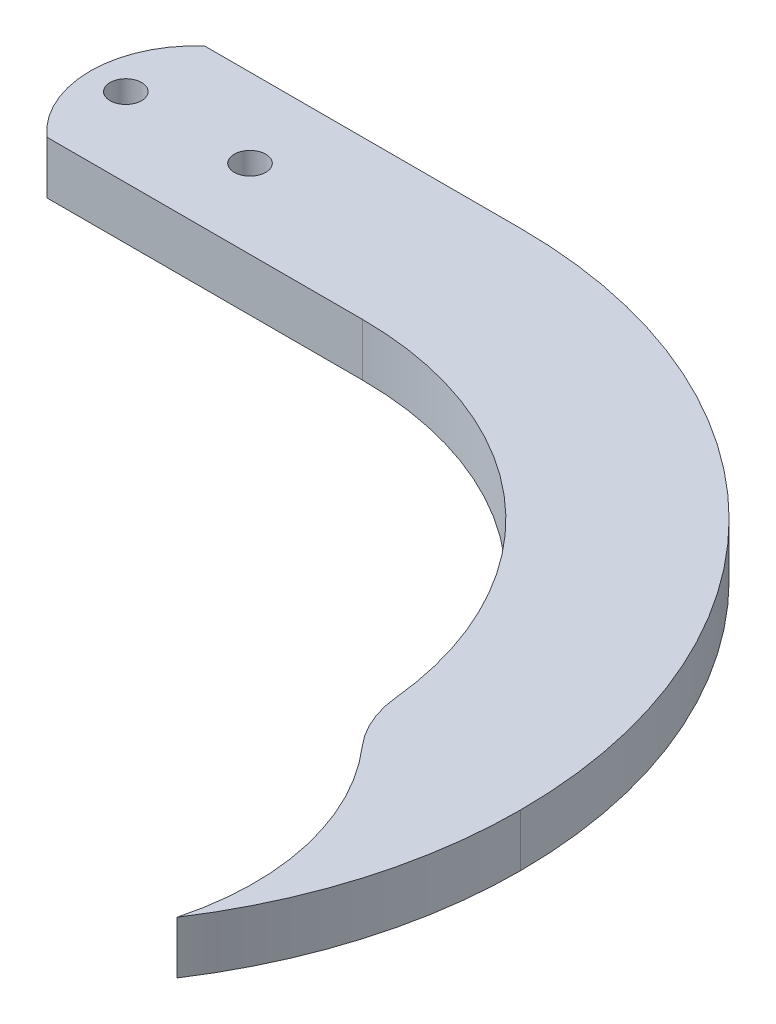
ISO-10303-21;
HEADER;
FILE_DESCRIPTION(('STEP AP214'),'2;1');
FILE_NAME('part.step','',(''),(''),'','','');
FILE_SCHEMA(('AUTOMOTIVE_DESIGN { 1 0 10303 214 1 1 1 1 }'));
ENDSEC;
DATA;
#1=APPLICATION_CONTEXT('core data for automotive mechanical design processes');
#2=APPLICATION_PROTOCOL_DEFINITION('international standard','automotive_design',2000,#1);
#3=PRODUCT_CONTEXT('',#1,'mechanical');
#4=PRODUCT('Part','Part','',(#3));
#5=PRODUCT_RELATED_PRODUCT_CATEGORY('part','',(#4));
#6=PRODUCT_DEFINITION_FORMATION('','',#4);
#7=PRODUCT_DEFINITION_CONTEXT('part definition',#1,'design');
#8=PRODUCT_DEFINITION('design','',#6,#7);
#9=PRODUCT_DEFINITION_SHAPE('','',#8);
#10=(LENGTH_UNIT() NAMED_UNIT(*) SI_UNIT(.MILLI.,.METRE.));
#11=(NAMED_UNIT(*) PLANE_ANGLE_UNIT() SI_UNIT($,.RADIAN.));
#12=(NAMED_UNIT(*) SI_UNIT($,.STERADIAN.) SOLID_ANGLE_UNIT());
#13=UNCERTAINTY_MEASURE_WITH_UNIT(LENGTH_MEASURE(1.E-05),#10,'distance_accuracy_value','');
#14=(GEOMETRIC_REPRESENTATION_CONTEXT(3) GLOBAL_UNCERTAINTY_ASSIGNED_CONTEXT((#13)) GLOBAL_UNIT_ASSIGNED_CONTEXT((#10,
#11,#12)) REPRESENTATION_CONTEXT('',''));
#15=CARTESIAN_POINT('',(0.,0.,0.));
#16=DIRECTION('',(0.,0.,1.));
#17=DIRECTION('',(1.,0.,0.));
#18=AXIS2_PLACEMENT_3D('',#15,#16,#17);
#19=CARTESIAN_POINT('',(0.,5.,0.));
#20=DIRECTION('',(0.,1.,0.));
#21=DIRECTION('',(0.,0.,1.));
#22=AXIS2_PLACEMENT_3D('',#19,#20,#21);
#23=PLANE('',#22);
#24=CARTESIAN_POINT('',(30.,5.,40.375));
#25=DIRECTION('',(0.,1.,0.));
#26=DIRECTION('',(0.,0.,1.));
#27=AXIS2_PLACEMENT_3D('',#24,#25,#26);
#28=CIRCLE('',#27,32.875);
#29=CARTESIAN_POINT('',(62.7098407903248,5.,37.0838086546663));
#30=VERTEX_POINT('',#29);
#31=CARTESIAN_POINT('',(30.,5.,7.5));
#32=VERTEX_POINT('',#31);
#33=EDGE_CURVE('E155',#30,#32,#28,.T.);
#34=ORIENTED_EDGE('',*,*,#33,.F.);
#35=CARTESIAN_POINT('',(72.6596022474579,5.,36.0826858119792));
#36=DIRECTION('',(0.,1.,0.));
#37=DIRECTION('',(0.,0.,1.));
#38=AXIS2_PLACEMENT_3D('',#35,#36,#37);
#39=CIRCLE('',#38,10.);
#40=CARTESIAN_POINT('',(65.1088411432145,5.,42.6390572738966));
#41=VERTEX_POINT('',#40);
#42=EDGE_CURVE('E14',#30,#41,#39,.T.);
#43=ORIENTED_EDGE('',*,*,#42,.T.);
#44=CARTESIAN_POINT('',(46.231938382606,5.,59.0299859286902));
#45=DIRECTION('',(0.,1.,0.));
#46=DIRECTION('',(0.,0.,1.));
#47=AXIS2_PLACEMENT_3D('',#44,#45,#46);
#48=CIRCLE('',#47,25.);
#49=CARTESIAN_POINT('',(70.375,5.,65.5194062216531));
#50=VERTEX_POINT('',#49);
#51=EDGE_CURVE('E115',#41,#50,#48,.F.);
#52=ORIENTED_EDGE('',*,*,#51,.T.);
#53=CARTESIAN_POINT('',(31.975589050699,5.,40.375));
#54=DIRECTION('',(0.,1.,0.));
#55=DIRECTION('',(0.,0.,1.));
#56=AXIS2_PLACEMENT_3D('',#53,#54,#55);
#57=CIRCLE('',#56,45.8994109493009);
#58=CARTESIAN_POINT('',(77.875,5.,40.375));
#59=VERTEX_POINT('',#58);
#60=EDGE_CURVE('E119',#59,#50,#57,.F.);
#61=ORIENTED_EDGE('',*,*,#60,.F.);
#62=CARTESIAN_POINT('',(30.,5.,40.375));
#63=DIRECTION('',(0.,1.,0.));
#64=DIRECTION('',(0.,0.,1.));
#65=AXIS2_PLACEMENT_3D('',#62,#63,#64);
#66=CIRCLE('',#65,47.875);
#67=CARTESIAN_POINT('',(30.,5.,-7.5));
#68=VERTEX_POINT('',#67);
#69=EDGE_CURVE('E157',#59,#68,#66,.T.);
#70=ORIENTED_EDGE('',*,*,#69,.T.);
#71=DIRECTION('',(1.,0.,0.));
#72=VECTOR('',#71,1.);
#73=CARTESIAN_POINT('',(0.,5.,-7.5));
#74=LINE('',#73,#72);
#75=CARTESIAN_POINT('',(0.,5.,-7.5));
#76=VERTEX_POINT('',#75);
#77=EDGE_CURVE('E159',#76,#68,#74,.T.);
#78=ORIENTED_EDGE('',*,*,#77,.F.);
#79=CARTESIAN_POINT('',(6.61437827766148,5.,0.));
#80=DIRECTION('',(0.,1.,0.));
#81=DIRECTION('',(0.,0.,1.));
#82=AXIS2_PLACEMENT_3D('',#79,#80,#81);
#83=CIRCLE('',#82,10.);
#84=CARTESIAN_POINT('',(0.,5.,7.5));
#85=VERTEX_POINT('',#84);
#86=EDGE_CURVE('E141',#76,#85,#83,.T.);
#87=ORIENTED_EDGE('',*,*,#86,.T.);
#88=DIRECTION('',(1.,0.,0.));
#89=VECTOR('',#88,1.);
#90=CARTESIAN_POINT('',(0.,5.,7.5));
#91=LINE('',#90,#89);
#92=EDGE_CURVE('E152',#85,#32,#91,.T.);
#93=ORIENTED_EDGE('',*,*,#92,.T.);
#94=EDGE_LOOP('',(#34,#43,#52,#61,#70,#78,#87,#93));
#95=FACE_BOUND('',#94,.T.);
#96=CARTESIAN_POINT('',(11.8,5.,0.));
#97=DIRECTION('',(0.,1.,0.));
#98=DIRECTION('',(0.,0.,1.));
#99=AXIS2_PLACEMENT_3D('',#96,#97,#98);
#100=CIRCLE('',#99,1.5);
#101=CARTESIAN_POINT('',(11.8,5.,1.5));
#102=VERTEX_POINT('',#101);
#103=EDGE_CURVE('E145',#102,#102,#100,.T.);
#104=ORIENTED_EDGE('',*,*,#103,.F.);
#105=EDGE_LOOP('',(#104));
#106=FACE_BOUND('',#105,.T.);
#107=CARTESIAN_POINT('',(0.,5.,0.));
#108=DIRECTION('',(0.,1.,0.));
#109=DIRECTION('',(0.,0.,1.));
#110=AXIS2_PLACEMENT_3D('',#107,#108,#109);
#111=CIRCLE('',#110,1.5);
#112=CARTESIAN_POINT('',(0.,5.,1.5));
#113=VERTEX_POINT('',#112);
#114=EDGE_CURVE('E148',#113,#113,#111,.T.);
#115=ORIENTED_EDGE('',*,*,#114,.F.);
#116=EDGE_LOOP('',(#115));
#117=FACE_BOUND('',#116,.T.);
#118=ADVANCED_FACE('F52',(#95,#106,#117),#23,.T.);
#119=CARTESIAN_POINT('',(0.,0.,0.));
#120=DIRECTION('',(0.,1.,0.));
#121=DIRECTION('',(0.,0.,1.));
#122=AXIS2_PLACEMENT_3D('',#119,#120,#121);
#123=PLANE('',#122);
#124=CARTESIAN_POINT('',(0.,0.,0.));
#125=DIRECTION('',(0.,1.,0.));
#126=DIRECTION('',(0.,0.,1.));
#127=AXIS2_PLACEMENT_3D('',#124,#125,#126);
#128=CIRCLE('',#127,1.5);
#129=CARTESIAN_POINT('',(0.,0.,1.5));
#130=VERTEX_POINT('',#129);
#131=EDGE_CURVE('E165',#130,#130,#128,.T.);
#132=ORIENTED_EDGE('',*,*,#131,.T.);
#133=EDGE_LOOP('',(#132));
#134=FACE_BOUND('',#133,.T.);
#135=CARTESIAN_POINT('',(11.8,0.,0.));
#136=DIRECTION('',(0.,1.,0.));
#137=DIRECTION('',(0.,0.,1.));
#138=AXIS2_PLACEMENT_3D('',#135,#136,#137);
#139=CIRCLE('',#138,1.5);
#140=CARTESIAN_POINT('',(11.8,0.,1.5));
#141=VERTEX_POINT('',#140);
#142=EDGE_CURVE('E144',#141,#141,#139,.T.);
#143=ORIENTED_EDGE('',*,*,#142,.T.);
#144=EDGE_LOOP('',(#143));
#145=FACE_BOUND('',#144,.T.);
#146=CARTESIAN_POINT('',(46.231938382606,0.,59.0299859286902));
#147=DIRECTION('',(0.,1.,0.));
#148=DIRECTION('',(0.,0.,1.));
#149=AXIS2_PLACEMENT_3D('',#146,#147,#148);
#150=CIRCLE('',#149,25.);
#151=CARTESIAN_POINT('',(70.375,0.,65.5194062216531));
#152=VERTEX_POINT('',#151);
#153=CARTESIAN_POINT('',(65.1088411432145,0.,42.6390572738966));
#154=VERTEX_POINT('',#153);
#155=EDGE_CURVE('E130',#152,#154,#150,.T.);
#156=ORIENTED_EDGE('',*,*,#155,.T.);
#157=CARTESIAN_POINT('',(72.6596022474579,0.,36.0826858119792));
#158=DIRECTION('',(0.,1.,0.));
#159=DIRECTION('',(0.,0.,1.));
#160=AXIS2_PLACEMENT_3D('',#157,#158,#159);
#161=CIRCLE('',#160,10.);
#162=CARTESIAN_POINT('',(62.7098407903248,0.,37.0838086546663));
#163=VERTEX_POINT('',#162);
#164=EDGE_CURVE('E74',#154,#163,#161,.F.);
#165=ORIENTED_EDGE('',*,*,#164,.T.);
#166=CARTESIAN_POINT('',(30.,0.,40.375));
#167=DIRECTION('',(0.,1.,0.));
#168=DIRECTION('',(0.,0.,1.));
#169=AXIS2_PLACEMENT_3D('',#166,#167,#168);
#170=CIRCLE('',#169,32.875);
#171=CARTESIAN_POINT('',(30.,0.,7.5));
#172=VERTEX_POINT('',#171);
#173=EDGE_CURVE('E171',#163,#172,#170,.T.);
#174=ORIENTED_EDGE('',*,*,#173,.T.);
#175=DIRECTION('',(1.,0.,0.));
#176=VECTOR('',#175,1.);
#177=CARTESIAN_POINT('',(0.,0.,7.5));
#178=LINE('',#177,#176);
#179=CARTESIAN_POINT('',(0.,0.,7.5));
#180=VERTEX_POINT('',#179);
#181=EDGE_CURVE('E168',#180,#172,#178,.T.);
#182=ORIENTED_EDGE('',*,*,#181,.F.);
#183=CARTESIAN_POINT('',(6.61437827766148,0.,0.));
#184=DIRECTION('',(0.,1.,0.));
#185=DIRECTION('',(0.,0.,1.));
#186=AXIS2_PLACEMENT_3D('',#183,#184,#185);
#187=CIRCLE('',#186,10.);
#188=CARTESIAN_POINT('',(0.,0.,-7.5));
#189=VERTEX_POINT('',#188);
#190=EDGE_CURVE('E188',#189,#180,#187,.T.);
#191=ORIENTED_EDGE('',*,*,#190,.F.);
#192=DIRECTION('',(1.,0.,0.));
#193=VECTOR('',#192,1.);
#194=CARTESIAN_POINT('',(0.,0.,-7.5));
#195=LINE('',#194,#193);
#196=CARTESIAN_POINT('',(30.,0.,-7.5));
#197=VERTEX_POINT('',#196);
#198=EDGE_CURVE('E149',#189,#197,#195,.T.);
#199=ORIENTED_EDGE('',*,*,#198,.T.);
#200=CARTESIAN_POINT('',(30.,0.,40.375));
#201=DIRECTION('',(0.,1.,0.));
#202=DIRECTION('',(0.,0.,1.));
#203=AXIS2_PLACEMENT_3D('',#200,#201,#202);
#204=CIRCLE('',#203,47.875);
#205=CARTESIAN_POINT('',(77.875,0.,40.375));
#206=VERTEX_POINT('',#205);
#207=EDGE_CURVE('E173',#206,#197,#204,.T.);
#208=ORIENTED_EDGE('',*,*,#207,.F.);
#209=CARTESIAN_POINT('',(31.975589050699,0.,40.375));
#210=DIRECTION('',(0.,1.,0.));
#211=DIRECTION('',(0.,0.,1.));
#212=AXIS2_PLACEMENT_3D('',#209,#210,#211);
#213=CIRCLE('',#212,45.8994109493009);
#214=EDGE_CURVE('E132',#152,#206,#213,.T.);
#215=ORIENTED_EDGE('',*,*,#214,.F.);
#216=EDGE_LOOP('',(#156,#165,#174,#182,#191,#199,#208,#215));
#217=FACE_BOUND('',#216,.T.);
#218=ADVANCED_FACE('F193',(#134,#145,#217),#123,.F.);
#219=CARTESIAN_POINT('',(0.,5.,7.5));
#220=DIRECTION('',(0.,0.,-1.));
#221=DIRECTION('',(-1.,0.,0.));
#222=AXIS2_PLACEMENT_3D('',#219,#220,#221);
#223=PLANE('',#222);
#224=ORIENTED_EDGE('',*,*,#181,.T.);
#225=DIRECTION('',(0.,-1.,0.));
#226=VECTOR('',#225,1.);
#227=CARTESIAN_POINT('',(30.,5.,7.5));
#228=LINE('',#227,#226);
#229=EDGE_CURVE('E185',#32,#172,#228,.T.);
#230=ORIENTED_EDGE('',*,*,#229,.F.);
#231=ORIENTED_EDGE('',*,*,#92,.F.);
#232=DIRECTION('',(0.,-1.,0.));
#233=VECTOR('',#232,1.);
#234=CARTESIAN_POINT('',(0.,5.,7.5));
#235=LINE('',#234,#233);
#236=EDGE_CURVE('E162',#85,#180,#235,.T.);
#237=ORIENTED_EDGE('',*,*,#236,.T.);
#238=EDGE_LOOP('',(#224,#230,#231,#237));
#239=FACE_BOUND('',#238,.T.);
#240=ADVANCED_FACE('F210',(#239),#223,.F.);
#241=CARTESIAN_POINT('',(30.,5.,40.375));
#242=DIRECTION('',(0.,-1.,0.));
#243=DIRECTION('',(0.,0.,-1.));
#244=AXIS2_PLACEMENT_3D('',#241,#242,#243);
#245=CYLINDRICAL_SURFACE('',#244,32.875);
#246=ORIENTED_EDGE('',*,*,#173,.F.);
#247=DIRECTION('',(0.,-1.,0.));
#248=VECTOR('',#247,1.);
#249=CARTESIAN_POINT('',(62.7098407903248,5.,37.0838086546663));
#250=LINE('',#249,#248);
#251=EDGE_CURVE('E60',#163,#30,#250,.F.);
#252=ORIENTED_EDGE('',*,*,#251,.T.);
#253=ORIENTED_EDGE('',*,*,#33,.T.);
#254=ORIENTED_EDGE('',*,*,#229,.T.);
#255=EDGE_LOOP('',(#246,#252,#253,#254));
#256=FACE_BOUND('',#255,.T.);
#257=ADVANCED_FACE('F230',(#256),#245,.F.);
#258=CARTESIAN_POINT('',(30.,5.,40.375));
#259=DIRECTION('',(0.,-1.,0.));
#260=DIRECTION('',(0.,0.,-1.));
#261=AXIS2_PLACEMENT_3D('',#258,#259,#260);
#262=CYLINDRICAL_SURFACE('',#261,47.875);
#263=ORIENTED_EDGE('',*,*,#207,.T.);
#264=DIRECTION('',(0.,-1.,0.));
#265=VECTOR('',#264,1.);
#266=CARTESIAN_POINT('',(30.,5.,-7.5));
#267=LINE('',#266,#265);
#268=EDGE_CURVE('E182',#68,#197,#267,.T.);
#269=ORIENTED_EDGE('',*,*,#268,.F.);
#270=ORIENTED_EDGE('',*,*,#69,.F.);
#271=DIRECTION('',(0.,-1.,0.));
#272=VECTOR('',#271,1.);
#273=CARTESIAN_POINT('',(77.875,5.,40.375));
#274=LINE('',#273,#272);
#275=EDGE_CURVE('E136',#59,#206,#274,.T.);
#276=ORIENTED_EDGE('',*,*,#275,.T.);
#277=EDGE_LOOP('',(#263,#269,#270,#276));
#278=FACE_BOUND('',#277,.T.);
#279=ADVANCED_FACE('F196',(#278),#262,.T.);
#280=CARTESIAN_POINT('',(0.,5.,-7.5));
#281=DIRECTION('',(0.,0.,-1.));
#282=DIRECTION('',(-1.,0.,0.));
#283=AXIS2_PLACEMENT_3D('',#280,#281,#282);
#284=PLANE('',#283);
#285=ORIENTED_EDGE('',*,*,#198,.F.);
#286=DIRECTION('',(0.,-1.,0.));
#287=VECTOR('',#286,1.);
#288=CARTESIAN_POINT('',(0.,5.,-7.5));
#289=LINE('',#288,#287);
#290=EDGE_CURVE('E180',#76,#189,#289,.T.);
#291=ORIENTED_EDGE('',*,*,#290,.F.);
#292=ORIENTED_EDGE('',*,*,#77,.T.);
#293=ORIENTED_EDGE('',*,*,#268,.T.);
#294=EDGE_LOOP('',(#285,#291,#292,#293));
#295=FACE_BOUND('',#294,.T.);
#296=ADVANCED_FACE('F203',(#295),#284,.T.);
#297=CARTESIAN_POINT('',(0.,5.,0.));
#298=DIRECTION('',(0.,-1.,0.));
#299=DIRECTION('',(0.,0.,-1.));
#300=AXIS2_PLACEMENT_3D('',#297,#298,#299);
#301=CYLINDRICAL_SURFACE('',#300,1.5);
#302=ORIENTED_EDGE('',*,*,#114,.T.);
#303=EDGE_LOOP('',(#302));
#304=FACE_BOUND('',#303,.T.);
#305=ORIENTED_EDGE('',*,*,#131,.F.);
#306=EDGE_LOOP('',(#305));
#307=FACE_BOUND('',#306,.T.);
#308=ADVANCED_FACE('F227',(#304,#307),#301,.F.);
#309=CARTESIAN_POINT('',(11.8,5.,0.));
#310=DIRECTION('',(0.,-1.,0.));
#311=DIRECTION('',(0.,0.,-1.));
#312=AXIS2_PLACEMENT_3D('',#309,#310,#311);
#313=CYLINDRICAL_SURFACE('',#312,1.5);
#314=ORIENTED_EDGE('',*,*,#103,.T.);
#315=EDGE_LOOP('',(#314));
#316=FACE_BOUND('',#315,.T.);
#317=ORIENTED_EDGE('',*,*,#142,.F.);
#318=EDGE_LOOP('',(#317));
#319=FACE_BOUND('',#318,.T.);
#320=ADVANCED_FACE('F236',(#316,#319),#313,.F.);
#321=CARTESIAN_POINT('',(6.61437827766148,-5.,0.));
#322=DIRECTION('',(0.,1.,0.));
#323=DIRECTION('',(0.,0.,1.));
#324=AXIS2_PLACEMENT_3D('',#321,#322,#323);
#325=CYLINDRICAL_SURFACE('',#324,10.);
#326=ORIENTED_EDGE('',*,*,#190,.T.);
#327=ORIENTED_EDGE('',*,*,#236,.F.);
#328=ORIENTED_EDGE('',*,*,#86,.F.);
#329=ORIENTED_EDGE('',*,*,#290,.T.);
#330=EDGE_LOOP('',(#326,#327,#328,#329));
#331=FACE_BOUND('',#330,.T.);
#332=ADVANCED_FACE('F206',(#331),#325,.T.);
#333=CARTESIAN_POINT('',(31.975589050699,-26.8413417200407,40.375));
#334=DIRECTION('',(0.,1.,0.));
#335=DIRECTION('',(0.,0.,1.));
#336=AXIS2_PLACEMENT_3D('',#333,#334,#335);
#337=CYLINDRICAL_SURFACE('',#336,45.8994109493009);
#338=DIRECTION('',(0.,1.,0.));
#339=VECTOR('',#338,1.);
#340=CARTESIAN_POINT('',(70.375,-26.8413417200407,65.5194062216531));
#341=LINE('',#340,#339);
#342=EDGE_CURVE('E128',#152,#50,#341,.T.);
#343=ORIENTED_EDGE('',*,*,#342,.F.);
#344=ORIENTED_EDGE('',*,*,#214,.T.);
#345=ORIENTED_EDGE('',*,*,#275,.F.);
#346=ORIENTED_EDGE('',*,*,#60,.T.);
#347=EDGE_LOOP('',(#343,#344,#345,#346));
#348=FACE_BOUND('',#347,.T.);
#349=ADVANCED_FACE('F134',(#348),#337,.T.);
#350=CARTESIAN_POINT('',(46.231938382606,-26.8413417200407,59.0299859286902));
#351=DIRECTION('',(0.,1.,0.));
#352=DIRECTION('',(0.,0.,1.));
#353=AXIS2_PLACEMENT_3D('',#350,#351,#352);
#354=CYLINDRICAL_SURFACE('',#353,25.);
#355=ORIENTED_EDGE('',*,*,#51,.F.);
#356=DIRECTION('',(0.,1.,0.));
#357=VECTOR('',#356,1.);
#358=CARTESIAN_POINT('',(65.1088411432145,-26.8413417200407,42.6390572738966));
#359=LINE('',#358,#357);
#360=EDGE_CURVE('E190',#41,#154,#359,.F.);
#361=ORIENTED_EDGE('',*,*,#360,.T.);
#362=ORIENTED_EDGE('',*,*,#155,.F.);
#363=ORIENTED_EDGE('',*,*,#342,.T.);
#364=EDGE_LOOP('',(#355,#361,#362,#363));
#365=FACE_BOUND('',#364,.T.);
#366=ADVANCED_FACE('F129',(#365),#354,.F.);
#367=CARTESIAN_POINT('',(72.6596022474579,5.,36.0826858119792));
#368=DIRECTION('',(0.,-1.,0.));
#369=DIRECTION('',(0.,0.,-1.));
#370=AXIS2_PLACEMENT_3D('',#367,#368,#369);
#371=CYLINDRICAL_SURFACE('',#370,10.);
#372=ORIENTED_EDGE('',*,*,#42,.F.);
#373=ORIENTED_EDGE('',*,*,#251,.F.);
#374=ORIENTED_EDGE('',*,*,#164,.F.);
#375=ORIENTED_EDGE('',*,*,#360,.F.);
#376=EDGE_LOOP('',(#372,#373,#374,#375));
#377=FACE_BOUND('',#376,.T.);
#378=ADVANCED_FACE('F54',(#377),#371,.T.);
#379=CLOSED_SHELL('',(#118,#218,#240,#257,#279,#296,#308,#320,#332,#349,#366,#378));
#380=MANIFOLD_SOLID_BREP('B2',#379);
#381=ADVANCED_BREP_SHAPE_REPRESENTATION('',(#18,#380),#14);
#382=SHAPE_DEFINITION_REPRESENTATION(#9,#381);
ENDSEC;
END-ISO-10303-21;
